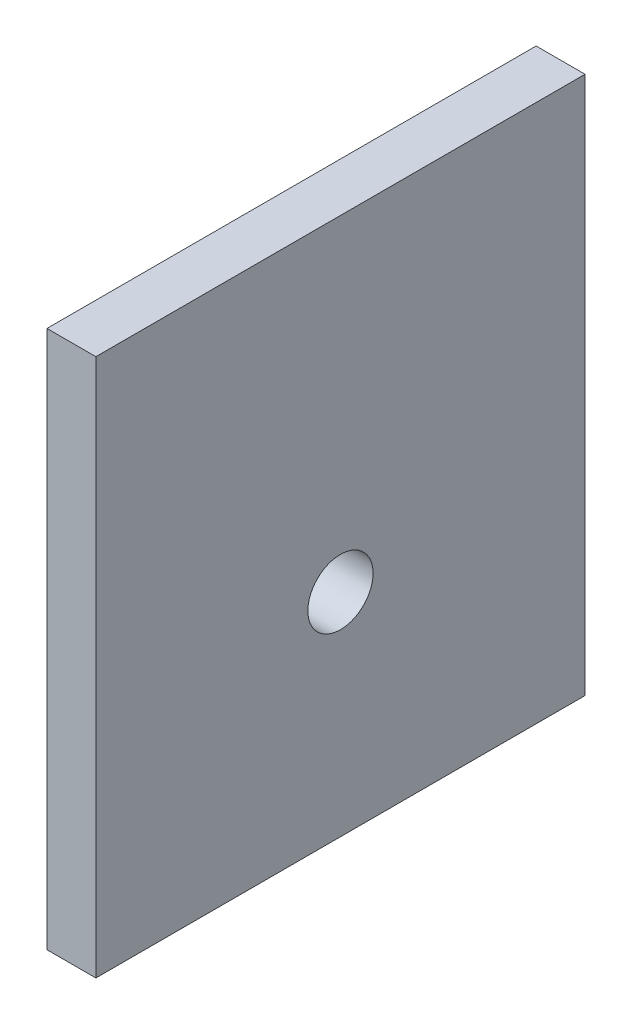
ISO-10303-21;
HEADER;
FILE_DESCRIPTION(('STEP AP214'),'2;1');
FILE_NAME('part.step','',(''),(''),'','','');
FILE_SCHEMA(('AUTOMOTIVE_DESIGN { 1 0 10303 214 1 1 1 1 }'));
ENDSEC;
DATA;
#1=APPLICATION_CONTEXT('core data for automotive mechanical design processes');
#2=APPLICATION_PROTOCOL_DEFINITION('international standard','automotive_design',2000,#1);
#3=PRODUCT_CONTEXT('',#1,'mechanical');
#4=PRODUCT('Part','Part','',(#3));
#5=PRODUCT_RELATED_PRODUCT_CATEGORY('part','',(#4));
#6=PRODUCT_DEFINITION_FORMATION('','',#4);
#7=PRODUCT_DEFINITION_CONTEXT('part definition',#1,'design');
#8=PRODUCT_DEFINITION('design','',#6,#7);
#9=PRODUCT_DEFINITION_SHAPE('','',#8);
#10=(LENGTH_UNIT() NAMED_UNIT(*) SI_UNIT(.MILLI.,.METRE.));
#11=(NAMED_UNIT(*) PLANE_ANGLE_UNIT() SI_UNIT($,.RADIAN.));
#12=(NAMED_UNIT(*) SI_UNIT($,.STERADIAN.) SOLID_ANGLE_UNIT());
#13=UNCERTAINTY_MEASURE_WITH_UNIT(LENGTH_MEASURE(1.E-05),#10,'distance_accuracy_value','');
#14=(GEOMETRIC_REPRESENTATION_CONTEXT(3) GLOBAL_UNCERTAINTY_ASSIGNED_CONTEXT((#13)) GLOBAL_UNIT_ASSIGNED_CONTEXT((#10,
#11,#12)) REPRESENTATION_CONTEXT('',''));
#15=CARTESIAN_POINT('',(0.,0.,0.));
#16=DIRECTION('',(0.,0.,1.));
#17=DIRECTION('',(1.,0.,0.));
#18=AXIS2_PLACEMENT_3D('',#15,#16,#17);
#19=CARTESIAN_POINT('',(3.,-20.,15.));
#20=DIRECTION('',(0.,0.,-1.));
#21=DIRECTION('',(-1.,0.,0.));
#22=AXIS2_PLACEMENT_3D('',#19,#20,#21);
#23=PLANE('',#22);
#24=DIRECTION('',(0.,-1.,0.));
#25=VECTOR('',#24,1.);
#26=CARTESIAN_POINT('',(0.,-20.,15.));
#27=LINE('',#26,#25);
#28=CARTESIAN_POINT('',(0.,20.,15.));
#29=VERTEX_POINT('',#28);
#30=CARTESIAN_POINT('',(0.,-13.,15.));
#31=VERTEX_POINT('',#30);
#32=EDGE_CURVE('E80',#29,#31,#27,.T.);
#33=ORIENTED_EDGE('',*,*,#32,.T.);
#34=DIRECTION('',(-1.,0.,0.));
#35=VECTOR('',#34,1.);
#36=CARTESIAN_POINT('',(3.,-13.,15.));
#37=LINE('',#36,#35);
#38=CARTESIAN_POINT('',(3.,-13.,15.));
#39=VERTEX_POINT('',#38);
#40=EDGE_CURVE('E46',#39,#31,#37,.T.);
#41=ORIENTED_EDGE('',*,*,#40,.F.);
#42=DIRECTION('',(0.,-1.,0.));
#43=VECTOR('',#42,1.);
#44=CARTESIAN_POINT('',(3.,-20.,15.));
#45=LINE('',#44,#43);
#46=CARTESIAN_POINT('',(3.,20.,15.));
#47=VERTEX_POINT('',#46);
#48=EDGE_CURVE('E75',#47,#39,#45,.T.);
#49=ORIENTED_EDGE('',*,*,#48,.F.);
#50=DIRECTION('',(-1.,0.,0.));
#51=VECTOR('',#50,1.);
#52=CARTESIAN_POINT('',(3.,20.,15.));
#53=LINE('',#52,#51);
#54=EDGE_CURVE('E39',#47,#29,#53,.T.);
#55=ORIENTED_EDGE('',*,*,#54,.T.);
#56=EDGE_LOOP('',(#33,#41,#49,#55));
#57=FACE_BOUND('',#56,.T.);
#58=ADVANCED_FACE('F32',(#57),#23,.F.);
#59=CARTESIAN_POINT('',(3.,-20.,-15.));
#60=DIRECTION('',(0.,0.,1.));
#61=DIRECTION('',(1.,0.,0.));
#62=AXIS2_PLACEMENT_3D('',#59,#60,#61);
#63=PLANE('',#62);
#64=DIRECTION('',(0.,1.,0.));
#65=VECTOR('',#64,1.);
#66=CARTESIAN_POINT('',(3.,-20.,-15.));
#67=LINE('',#66,#65);
#68=CARTESIAN_POINT('',(3.,-13.,-15.));
#69=VERTEX_POINT('',#68);
#70=CARTESIAN_POINT('',(3.,20.,-15.));
#71=VERTEX_POINT('',#70);
#72=EDGE_CURVE('E91',#69,#71,#67,.T.);
#73=ORIENTED_EDGE('',*,*,#72,.F.);
#74=DIRECTION('',(-1.,0.,0.));
#75=VECTOR('',#74,1.);
#76=CARTESIAN_POINT('',(3.,-13.,-15.));
#77=LINE('',#76,#75);
#78=CARTESIAN_POINT('',(0.,-13.,-15.));
#79=VERTEX_POINT('',#78);
#80=EDGE_CURVE('E95',#69,#79,#77,.T.);
#81=ORIENTED_EDGE('',*,*,#80,.T.);
#82=DIRECTION('',(0.,1.,0.));
#83=VECTOR('',#82,1.);
#84=CARTESIAN_POINT('',(0.,-20.,-15.));
#85=LINE('',#84,#83);
#86=CARTESIAN_POINT('',(0.,20.,-15.));
#87=VERTEX_POINT('',#86);
#88=EDGE_CURVE('E76',#79,#87,#85,.T.);
#89=ORIENTED_EDGE('',*,*,#88,.T.);
#90=DIRECTION('',(-1.,0.,0.));
#91=VECTOR('',#90,1.);
#92=CARTESIAN_POINT('',(3.,20.,-15.));
#93=LINE('',#92,#91);
#94=EDGE_CURVE('E11',#71,#87,#93,.T.);
#95=ORIENTED_EDGE('',*,*,#94,.F.);
#96=EDGE_LOOP('',(#73,#81,#89,#95));
#97=FACE_BOUND('',#96,.T.);
#98=ADVANCED_FACE('F110',(#97),#63,.F.);
#99=CARTESIAN_POINT('',(3.,20.,-15.));
#100=DIRECTION('',(0.,-1.,0.));
#101=DIRECTION('',(0.,0.,-1.));
#102=AXIS2_PLACEMENT_3D('',#99,#100,#101);
#103=PLANE('',#102);
#104=DIRECTION('',(0.,0.,1.));
#105=VECTOR('',#104,1.);
#106=CARTESIAN_POINT('',(0.,20.,-15.));
#107=LINE('',#106,#105);
#108=EDGE_CURVE('E67',#87,#29,#107,.T.);
#109=ORIENTED_EDGE('',*,*,#108,.T.);
#110=ORIENTED_EDGE('',*,*,#54,.F.);
#111=DIRECTION('',(0.,0.,1.));
#112=VECTOR('',#111,1.);
#113=CARTESIAN_POINT('',(3.,20.,-15.));
#114=LINE('',#113,#112);
#115=EDGE_CURVE('E55',#71,#47,#114,.T.);
#116=ORIENTED_EDGE('',*,*,#115,.F.);
#117=ORIENTED_EDGE('',*,*,#94,.T.);
#118=EDGE_LOOP('',(#109,#110,#116,#117));
#119=FACE_BOUND('',#118,.T.);
#120=ADVANCED_FACE('F69',(#119),#103,.F.);
#121=CARTESIAN_POINT('',(3.,0.,0.));
#122=DIRECTION('',(1.,0.,0.));
#123=DIRECTION('',(0.,0.,-1.));
#124=AXIS2_PLACEMENT_3D('',#121,#122,#123);
#125=PLANE('',#124);
#126=DIRECTION('',(0.,0.,-1.));
#127=VECTOR('',#126,1.);
#128=CARTESIAN_POINT('',(3.,-13.,15.));
#129=LINE('',#128,#127);
#130=EDGE_CURVE('E98',#39,#69,#129,.T.);
#131=ORIENTED_EDGE('',*,*,#130,.T.);
#132=ORIENTED_EDGE('',*,*,#72,.T.);
#133=ORIENTED_EDGE('',*,*,#115,.T.);
#134=ORIENTED_EDGE('',*,*,#48,.T.);
#135=EDGE_LOOP('',(#131,#132,#133,#134));
#136=FACE_BOUND('',#135,.T.);
#137=CARTESIAN_POINT('',(3.,0.,0.));
#138=DIRECTION('',(1.,0.,0.));
#139=DIRECTION('',(0.,0.,-1.));
#140=AXIS2_PLACEMENT_3D('',#137,#138,#139);
#141=CIRCLE('',#140,2.);
#142=CARTESIAN_POINT('',(3.,0.,-2.));
#143=VERTEX_POINT('',#142);
#144=EDGE_CURVE('E87',#143,#143,#141,.T.);
#145=ORIENTED_EDGE('',*,*,#144,.F.);
#146=EDGE_LOOP('',(#145));
#147=FACE_BOUND('',#146,.T.);
#148=ADVANCED_FACE('F104',(#136,#147),#125,.T.);
#149=CARTESIAN_POINT('',(0.,0.,0.));
#150=DIRECTION('',(1.,0.,0.));
#151=DIRECTION('',(0.,0.,-1.));
#152=AXIS2_PLACEMENT_3D('',#149,#150,#151);
#153=PLANE('',#152);
#154=CARTESIAN_POINT('',(0.,0.,0.));
#155=DIRECTION('',(1.,0.,0.));
#156=DIRECTION('',(0.,0.,-1.));
#157=AXIS2_PLACEMENT_3D('',#154,#155,#156);
#158=CIRCLE('',#157,2.);
#159=CARTESIAN_POINT('',(0.,0.,-2.));
#160=VERTEX_POINT('',#159);
#161=EDGE_CURVE('E83',#160,#160,#158,.T.);
#162=ORIENTED_EDGE('',*,*,#161,.T.);
#163=EDGE_LOOP('',(#162));
#164=FACE_BOUND('',#163,.T.);
#165=ORIENTED_EDGE('',*,*,#88,.F.);
#166=DIRECTION('',(0.,0.,-1.));
#167=VECTOR('',#166,1.);
#168=CARTESIAN_POINT('',(0.,-13.,15.));
#169=LINE('',#168,#167);
#170=EDGE_CURVE('E82',#31,#79,#169,.T.);
#171=ORIENTED_EDGE('',*,*,#170,.F.);
#172=ORIENTED_EDGE('',*,*,#32,.F.);
#173=ORIENTED_EDGE('',*,*,#108,.F.);
#174=EDGE_LOOP('',(#165,#171,#172,#173));
#175=FACE_BOUND('',#174,.T.);
#176=ADVANCED_FACE('F81',(#164,#175),#153,.F.);
#177=CARTESIAN_POINT('',(0.,0.,0.));
#178=DIRECTION('',(1.,0.,0.));
#179=DIRECTION('',(0.,0.,-1.));
#180=AXIS2_PLACEMENT_3D('',#177,#178,#179);
#181=CYLINDRICAL_SURFACE('',#180,2.);
#182=ORIENTED_EDGE('',*,*,#161,.F.);
#183=EDGE_LOOP('',(#182));
#184=FACE_BOUND('',#183,.T.);
#185=ORIENTED_EDGE('',*,*,#144,.T.);
#186=EDGE_LOOP('',(#185));
#187=FACE_BOUND('',#186,.T.);
#188=ADVANCED_FACE('F115',(#184,#187),#181,.F.);
#189=CARTESIAN_POINT('',(3.,-13.,15.));
#190=DIRECTION('',(0.,1.,0.));
#191=DIRECTION('',(0.,0.,1.));
#192=AXIS2_PLACEMENT_3D('',#189,#190,#191);
#193=PLANE('',#192);
#194=ORIENTED_EDGE('',*,*,#170,.T.);
#195=ORIENTED_EDGE('',*,*,#80,.F.);
#196=ORIENTED_EDGE('',*,*,#130,.F.);
#197=ORIENTED_EDGE('',*,*,#40,.T.);
#198=EDGE_LOOP('',(#194,#195,#196,#197));
#199=FACE_BOUND('',#198,.T.);
#200=ADVANCED_FACE('F113',(#199),#193,.F.);
#201=CLOSED_SHELL('',(#58,#98,#120,#148,#176,#188,#200));
#202=MANIFOLD_SOLID_BREP('B2',#201);
#203=ADVANCED_BREP_SHAPE_REPRESENTATION('',(#18,#202),#14);
#204=SHAPE_DEFINITION_REPRESENTATION(#9,#203);
ENDSEC;
END-ISO-10303-21;
